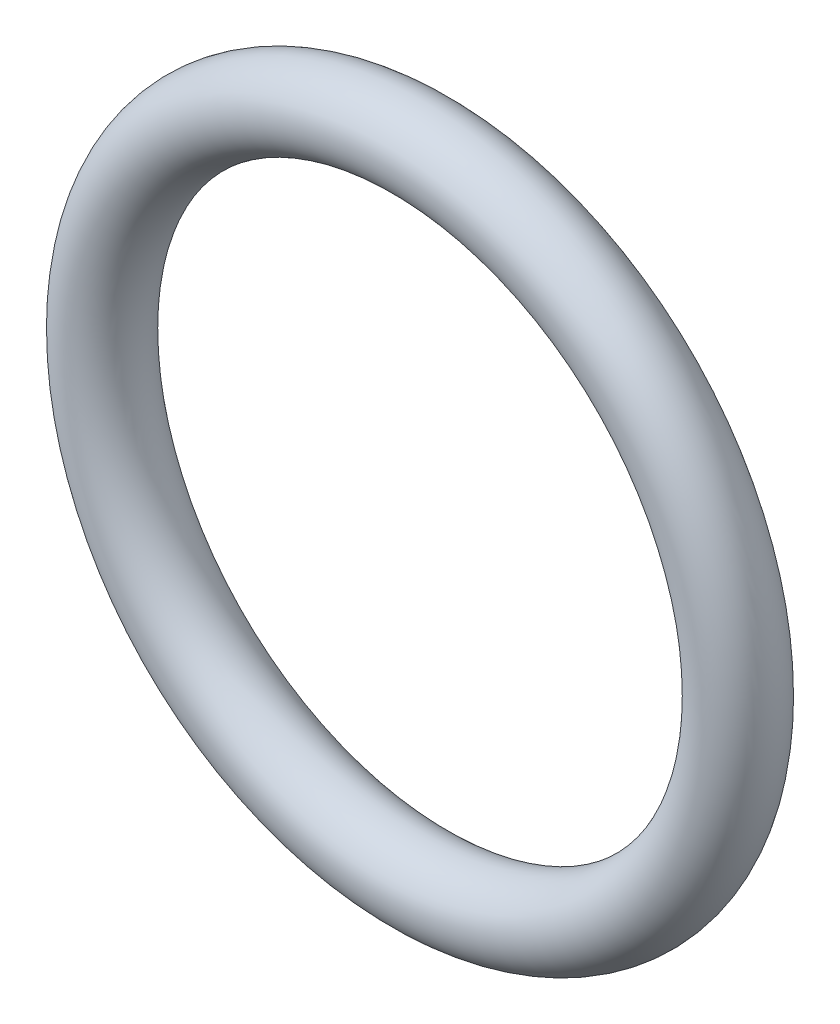
ISO-10303-21;
HEADER;
FILE_DESCRIPTION(('STEP AP214'),'2;1');
FILE_NAME('part.step','',(''),(''),'','','');
FILE_SCHEMA(('AUTOMOTIVE_DESIGN { 1 0 10303 214 1 1 1 1 }'));
ENDSEC;
DATA;
#1=APPLICATION_CONTEXT('core data for automotive mechanical design processes');
#2=APPLICATION_PROTOCOL_DEFINITION('international standard','automotive_design',2000,#1);
#3=PRODUCT_CONTEXT('',#1,'mechanical');
#4=PRODUCT('Part','Part','',(#3));
#5=PRODUCT_RELATED_PRODUCT_CATEGORY('part','',(#4));
#6=PRODUCT_DEFINITION_FORMATION('','',#4);
#7=PRODUCT_DEFINITION_CONTEXT('part definition',#1,'design');
#8=PRODUCT_DEFINITION('design','',#6,#7);
#9=PRODUCT_DEFINITION_SHAPE('','',#8);
#10=(LENGTH_UNIT() NAMED_UNIT(*) SI_UNIT(.MILLI.,.METRE.));
#11=(NAMED_UNIT(*) PLANE_ANGLE_UNIT() SI_UNIT($,.RADIAN.));
#12=(NAMED_UNIT(*) SI_UNIT($,.STERADIAN.) SOLID_ANGLE_UNIT());
#13=UNCERTAINTY_MEASURE_WITH_UNIT(LENGTH_MEASURE(1.E-05),#10,'distance_accuracy_value','');
#14=(GEOMETRIC_REPRESENTATION_CONTEXT(3) GLOBAL_UNCERTAINTY_ASSIGNED_CONTEXT((#13)) GLOBAL_UNIT_ASSIGNED_CONTEXT((#10,
#11,#12)) REPRESENTATION_CONTEXT('',''));
#15=CARTESIAN_POINT('',(0.,0.,0.));
#16=DIRECTION('',(0.,0.,1.));
#17=DIRECTION('',(1.,0.,0.));
#18=AXIS2_PLACEMENT_3D('',#15,#16,#17);
#19=CARTESIAN_POINT('',(0.,0.,0.));
#20=DIRECTION('',(0.,0.,1.));
#21=DIRECTION('',(1.,0.,0.));
#22=AXIS2_PLACEMENT_3D('',#19,#20,#21);
#23=TOROIDAL_SURFACE('',#22,14.2621,1.7653);
#24=CARTESIAN_POINT('',(16.0274,0.,0.));
#25=VERTEX_POINT('',#24);
#26=VERTEX_LOOP('',#25);
#27=FACE_BOUND('',#26,.T.);
#28=ADVANCED_FACE('F37',(#27),#23,.T.);
#29=CLOSED_SHELL('',(#28));
#30=MANIFOLD_SOLID_BREP('B2',#29);
#31=ADVANCED_BREP_SHAPE_REPRESENTATION('',(#18,#30),#14);
#32=SHAPE_DEFINITION_REPRESENTATION(#9,#31);
ENDSEC;
END-ISO-10303-21;
